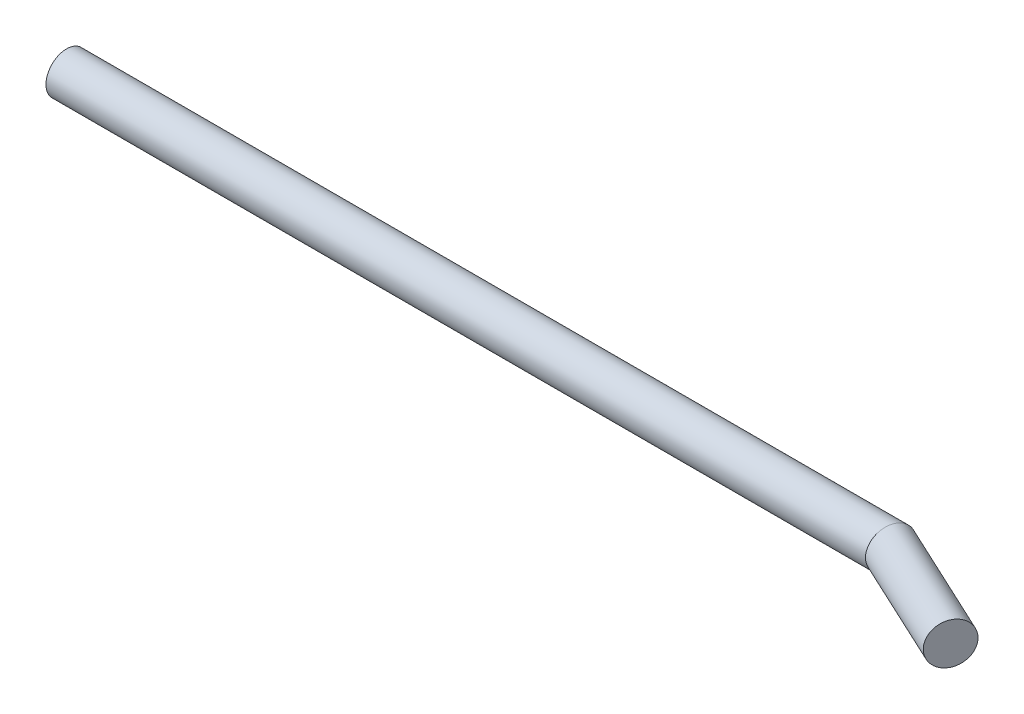
ISO-10303-21;
HEADER;
FILE_DESCRIPTION(('STEP AP214'),'2;1');
FILE_NAME('part.step','',(''),(''),'','','');
FILE_SCHEMA(('AUTOMOTIVE_DESIGN { 1 0 10303 214 1 1 1 1 }'));
ENDSEC;
DATA;
#1=APPLICATION_CONTEXT('core data for automotive mechanical design processes');
#2=APPLICATION_PROTOCOL_DEFINITION('international standard','automotive_design',2000,#1);
#3=PRODUCT_CONTEXT('',#1,'mechanical');
#4=PRODUCT('Part','Part','',(#3));
#5=PRODUCT_RELATED_PRODUCT_CATEGORY('part','',(#4));
#6=PRODUCT_DEFINITION_FORMATION('','',#4);
#7=PRODUCT_DEFINITION_CONTEXT('part definition',#1,'design');
#8=PRODUCT_DEFINITION('design','',#6,#7);
#9=PRODUCT_DEFINITION_SHAPE('','',#8);
#10=(LENGTH_UNIT() NAMED_UNIT(*) SI_UNIT(.MILLI.,.METRE.));
#11=(NAMED_UNIT(*) PLANE_ANGLE_UNIT() SI_UNIT($,.RADIAN.));
#12=(NAMED_UNIT(*) SI_UNIT($,.STERADIAN.) SOLID_ANGLE_UNIT());
#13=UNCERTAINTY_MEASURE_WITH_UNIT(LENGTH_MEASURE(1.E-05),#10,'distance_accuracy_value','');
#14=(GEOMETRIC_REPRESENTATION_CONTEXT(3) GLOBAL_UNCERTAINTY_ASSIGNED_CONTEXT((#13)) GLOBAL_UNIT_ASSIGNED_CONTEXT((#10,
#11,#12)) REPRESENTATION_CONTEXT('',''));
#15=CARTESIAN_POINT('',(0.,0.,0.));
#16=DIRECTION('',(0.,0.,1.));
#17=DIRECTION('',(1.,0.,0.));
#18=AXIS2_PLACEMENT_3D('',#15,#16,#17);
#19=CARTESIAN_POINT('',(-220.,0.,0.));
#20=DIRECTION('',(1.,0.,0.));
#21=DIRECTION('',(0.,0.,-1.));
#22=AXIS2_PLACEMENT_3D('',#19,#20,#21);
#23=PLANE('',#22);
#24=CARTESIAN_POINT('',(-220.,0.,0.));
#25=DIRECTION('',(1.,0.,0.));
#26=DIRECTION('',(0.,0.,-1.));
#27=AXIS2_PLACEMENT_3D('',#24,#25,#26);
#28=CIRCLE('',#27,5.5);
#29=CARTESIAN_POINT('',(-220.,0.,-5.5));
#30=VERTEX_POINT('',#29);
#31=EDGE_CURVE('E44',#30,#30,#28,.T.);
#32=ORIENTED_EDGE('',*,*,#31,.F.);
#33=EDGE_LOOP('',(#32));
#34=FACE_BOUND('',#33,.T.);
#35=ADVANCED_FACE('F41',(#34),#23,.F.);
#36=CARTESIAN_POINT('',(30.,0.,13.98922974465));
#37=DIRECTION('',(0.90630778703665,0.,0.4226182617407));
#38=DIRECTION('',(0.4226182617407,0.,-0.90630778703665));
#39=AXIS2_PLACEMENT_3D('',#36,#37,#38);
#40=PLANE('',#39);
#41=CARTESIAN_POINT('',(30.,0.,13.98922974465));
#42=DIRECTION('',(0.90630778703665,0.,0.4226182617407));
#43=DIRECTION('',(0.4226182617407,0.,-0.90630778703665));
#44=AXIS2_PLACEMENT_3D('',#41,#42,#43);
#45=CIRCLE('',#44,5.5);
#46=CARTESIAN_POINT('',(32.3244004395739,0.,9.00453691594842));
#47=VERTEX_POINT('',#46);
#48=EDGE_CURVE('E49',#47,#47,#45,.T.);
#49=ORIENTED_EDGE('',*,*,#48,.T.);
#50=EDGE_LOOP('',(#49));
#51=FACE_BOUND('',#50,.T.);
#52=ADVANCED_FACE('F64',(#51),#40,.T.);
#53=CARTESIAN_POINT('',(1.44125270898979,0.,0.));
#54=DIRECTION('',(-1.,0.,0.));
#55=DIRECTION('',(0.,0.,1.));
#56=AXIS2_PLACEMENT_3D('',#53,#54,#55);
#57=CYLINDRICAL_SURFACE('',#56,5.5);
#58=CARTESIAN_POINT('',(0.,0.,0.));
#59=DIRECTION('',(-0.976296007119933,0.,-0.216439613938103));
#60=DIRECTION('',(0.216439613938103,0.,-0.976296007119933));
#61=AXIS2_PLACEMENT_3D('',#58,#59,#60);
#62=ELLIPSE('',#61,5.6335373287298,5.5);
#63=CARTESIAN_POINT('',(1.21932064453617,0.,-5.5));
#64=VERTEX_POINT('',#63);
#65=EDGE_CURVE('E10',#64,#64,#62,.T.);
#66=ORIENTED_EDGE('',*,*,#65,.T.);
#67=EDGE_LOOP('',(#66));
#68=FACE_BOUND('',#67,.T.);
#69=ORIENTED_EDGE('',*,*,#31,.T.);
#70=EDGE_LOOP('',(#69));
#71=FACE_BOUND('',#70,.T.);
#72=ADVANCED_FACE('F61',(#68,#71),#57,.T.);
#73=CARTESIAN_POINT('',(30.,0.,13.98922974465));
#74=DIRECTION('',(-0.906307787036649,0.,-0.4226182617407));
#75=DIRECTION('',(-0.4226182617407,0.,0.90630778703665));
#76=AXIS2_PLACEMENT_3D('',#73,#74,#75);
#77=CYLINDRICAL_SURFACE('',#76,5.5);
#78=ORIENTED_EDGE('',*,*,#48,.F.);
#79=EDGE_LOOP('',(#78));
#80=FACE_BOUND('',#79,.T.);
#81=ORIENTED_EDGE('',*,*,#65,.F.);
#82=EDGE_LOOP('',(#81));
#83=FACE_BOUND('',#82,.T.);
#84=ADVANCED_FACE('F68',(#80,#83),#77,.T.);
#85=CLOSED_SHELL('',(#35,#52,#72,#84));
#86=MANIFOLD_SOLID_BREP('B2',#85);
#87=ADVANCED_BREP_SHAPE_REPRESENTATION('',(#18,#86),#14);
#88=SHAPE_DEFINITION_REPRESENTATION(#9,#87);
ENDSEC;
END-ISO-10303-21;
